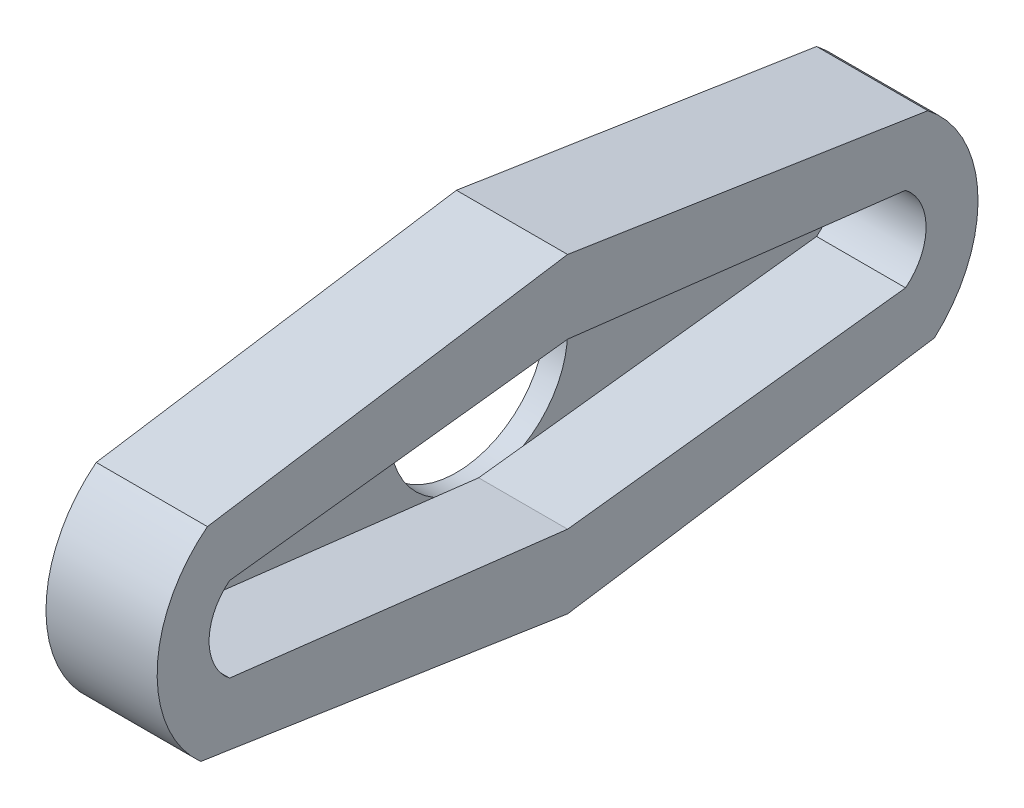
ISO-10303-21;
HEADER;
FILE_DESCRIPTION(('STEP AP214'),'2;1');
FILE_NAME('part.step','',(''),(''),'','','');
FILE_SCHEMA(('AUTOMOTIVE_DESIGN { 1 0 10303 214 1 1 1 1 }'));
ENDSEC;
DATA;
#1=APPLICATION_CONTEXT('core data for automotive mechanical design processes');
#2=APPLICATION_PROTOCOL_DEFINITION('international standard','automotive_design',2000,#1);
#3=PRODUCT_CONTEXT('',#1,'mechanical');
#4=PRODUCT('Part','Part','',(#3));
#5=PRODUCT_RELATED_PRODUCT_CATEGORY('part','',(#4));
#6=PRODUCT_DEFINITION_FORMATION('','',#4);
#7=PRODUCT_DEFINITION_CONTEXT('part definition',#1,'design');
#8=PRODUCT_DEFINITION('design','',#6,#7);
#9=PRODUCT_DEFINITION_SHAPE('','',#8);
#10=(LENGTH_UNIT() NAMED_UNIT(*) SI_UNIT(.MILLI.,.METRE.));
#11=(NAMED_UNIT(*) PLANE_ANGLE_UNIT() SI_UNIT($,.RADIAN.));
#12=(NAMED_UNIT(*) SI_UNIT($,.STERADIAN.) SOLID_ANGLE_UNIT());
#13=UNCERTAINTY_MEASURE_WITH_UNIT(LENGTH_MEASURE(1.E-05),#10,'distance_accuracy_value','');
#14=(GEOMETRIC_REPRESENTATION_CONTEXT(3) GLOBAL_UNCERTAINTY_ASSIGNED_CONTEXT((#13)) GLOBAL_UNIT_ASSIGNED_CONTEXT((#10,
#11,#12)) REPRESENTATION_CONTEXT('',''));
#15=CARTESIAN_POINT('',(0.,0.,0.));
#16=DIRECTION('',(0.,0.,1.));
#17=DIRECTION('',(1.,0.,0.));
#18=AXIS2_PLACEMENT_3D('',#15,#16,#17);
#19=CARTESIAN_POINT('',(0.,-0.125126562134235,-12.5962031359729));
#20=DIRECTION('',(-1.,0.,0.));
#21=DIRECTION('',(0.,0.,1.));
#22=AXIS2_PLACEMENT_3D('',#19,#20,#21);
#23=PLANE('',#22);
#24=CARTESIAN_POINT('',(0.,0.,0.));
#25=DIRECTION('',(1.,0.,0.));
#26=DIRECTION('',(0.,0.,-1.));
#27=AXIS2_PLACEMENT_3D('',#24,#25,#26);
#28=CIRCLE('',#27,4.);
#29=CARTESIAN_POINT('',(0.,3.46291458896751,-2.00205458205214));
#30=VERTEX_POINT('',#29);
#31=CARTESIAN_POINT('',(0.,3.46291458896751,2.00205458205214));
#32=VERTEX_POINT('',#31);
#33=EDGE_CURVE('E50',#30,#32,#28,.T.);
#34=ORIENTED_EDGE('',*,*,#33,.F.);
#35=DIRECTION('',(0.,0.117599343536163,0.993061123194269));
#36=VECTOR('',#35,1.);
#37=CARTESIAN_POINT('',(0.,3.7,0.));
#38=LINE('',#37,#36);
#39=CARTESIAN_POINT('',(0.,3.7,0.));
#40=VERTEX_POINT('',#39);
#41=EDGE_CURVE('E188',#30,#40,#38,.T.);
#42=ORIENTED_EDGE('',*,*,#41,.T.);
#43=DIRECTION('',(0.,-0.117599343536163,0.993061123194269));
#44=VECTOR('',#43,1.);
#45=CARTESIAN_POINT('',(0.,3.7,0.));
#46=LINE('',#45,#44);
#47=EDGE_CURVE('E214',#40,#32,#46,.T.);
#48=ORIENTED_EDGE('',*,*,#47,.T.);
#49=EDGE_LOOP('',(#34,#42,#48));
#50=FACE_BOUND('',#49,.T.);
#51=ADVANCED_FACE('F39',(#50),#23,.T.);
#52=CARTESIAN_POINT('',(0.,-3.46291458896751,2.00205458205214));
#53=VERTEX_POINT('',#52);
#54=CARTESIAN_POINT('',(0.,-3.46291458896751,-2.00205458205214));
#55=VERTEX_POINT('',#54);
#56=EDGE_CURVE('E11',#53,#55,#28,.T.);
#57=ORIENTED_EDGE('',*,*,#56,.F.);
#58=DIRECTION('',(0.,-0.117599343536163,-0.993061123194269));
#59=VECTOR('',#58,1.);
#60=CARTESIAN_POINT('',(0.,-1.9,15.2));
#61=LINE('',#60,#59);
#62=CARTESIAN_POINT('',(0.,-3.7,0.));
#63=VERTEX_POINT('',#62);
#64=EDGE_CURVE('E221',#53,#63,#61,.T.);
#65=ORIENTED_EDGE('',*,*,#64,.T.);
#66=DIRECTION('',(0.,0.117599343536164,-0.993061123194269));
#67=VECTOR('',#66,1.);
#68=CARTESIAN_POINT('',(0.,-1.9,-15.2));
#69=LINE('',#68,#67);
#70=EDGE_CURVE('E227',#63,#55,#69,.T.);
#71=ORIENTED_EDGE('',*,*,#70,.T.);
#72=EDGE_LOOP('',(#57,#65,#71));
#73=FACE_BOUND('',#72,.T.);
#74=ADVANCED_FACE('F310',(#73),#23,.T.);
#75=CARTESIAN_POINT('',(4.,-0.125126562134235,-12.5962031359729));
#76=DIRECTION('',(-1.,0.,0.));
#77=DIRECTION('',(0.,0.,1.));
#78=AXIS2_PLACEMENT_3D('',#75,#76,#77);
#79=PLANE('',#78);
#80=DIRECTION('',(0.,0.152515596279737,0.988301063892697));
#81=VECTOR('',#80,1.);
#82=CARTESIAN_POINT('',(4.,7.,0.));
#83=LINE('',#82,#81);
#84=CARTESIAN_POINT('',(4.,4.5,-16.2));
#85=VERTEX_POINT('',#84);
#86=CARTESIAN_POINT('',(4.,7.,0.));
#87=VERTEX_POINT('',#86);
#88=EDGE_CURVE('E253',#85,#87,#83,.T.);
#89=ORIENTED_EDGE('',*,*,#88,.T.);
#90=DIRECTION('',(0.,-0.152515596279737,0.988301063892697));
#91=VECTOR('',#90,1.);
#92=CARTESIAN_POINT('',(4.,7.,0.));
#93=LINE('',#92,#91);
#94=CARTESIAN_POINT('',(4.,4.5,16.2));
#95=VERTEX_POINT('',#94);
#96=EDGE_CURVE('E147',#87,#95,#93,.T.);
#97=ORIENTED_EDGE('',*,*,#96,.T.);
#98=CARTESIAN_POINT('',(4.,-0.125126562134238,12.5962031359729));
#99=DIRECTION('',(1.,0.,0.));
#100=DIRECTION('',(0.,0.,-1.));
#101=AXIS2_PLACEMENT_3D('',#98,#99,#100);
#102=CIRCLE('',#101,5.8633733936132);
#103=CARTESIAN_POINT('',(4.,-4.5,16.5));
#104=VERTEX_POINT('',#103);
#105=EDGE_CURVE('E258',#95,#104,#102,.T.);
#106=ORIENTED_EDGE('',*,*,#105,.T.);
#107=DIRECTION('',(0.,-0.149805379427995,-0.988715504224767));
#108=VECTOR('',#107,1.);
#109=CARTESIAN_POINT('',(4.,-4.5,16.5));
#110=LINE('',#109,#108);
#111=CARTESIAN_POINT('',(4.,-7.,0.));
#112=VERTEX_POINT('',#111);
#113=EDGE_CURVE('E261',#104,#112,#110,.T.);
#114=ORIENTED_EDGE('',*,*,#113,.T.);
#115=DIRECTION('',(0.,0.149805379427995,-0.988715504224767));
#116=VECTOR('',#115,1.);
#117=CARTESIAN_POINT('',(4.,-4.5,-16.5));
#118=LINE('',#117,#116);
#119=CARTESIAN_POINT('',(4.,-4.5,-16.5));
#120=VERTEX_POINT('',#119);
#121=EDGE_CURVE('E264',#112,#120,#118,.T.);
#122=ORIENTED_EDGE('',*,*,#121,.T.);
#123=CARTESIAN_POINT('',(4.,-0.125126562134235,-12.5962031359729));
#124=DIRECTION('',(1.,0.,0.));
#125=DIRECTION('',(0.,0.,1.));
#126=AXIS2_PLACEMENT_3D('',#123,#124,#125);
#127=CIRCLE('',#126,5.8633733936132);
#128=EDGE_CURVE('E267',#120,#85,#127,.T.);
#129=ORIENTED_EDGE('',*,*,#128,.T.);
#130=EDGE_LOOP('',(#89,#97,#106,#114,#122,#129));
#131=FACE_BOUND('',#130,.T.);
#132=DIRECTION('',(0.,0.117599343536163,0.993061123194269));
#133=VECTOR('',#132,1.);
#134=CARTESIAN_POINT('',(4.,3.7,0.));
#135=LINE('',#134,#133);
#136=CARTESIAN_POINT('',(4.,1.9,-15.2));
#137=VERTEX_POINT('',#136);
#138=CARTESIAN_POINT('',(4.,3.7,0.));
#139=VERTEX_POINT('',#138);
#140=EDGE_CURVE('E189',#137,#139,#135,.T.);
#141=ORIENTED_EDGE('',*,*,#140,.F.);
#142=CARTESIAN_POINT('',(4.,0.,-13.7066815476932));
#143=DIRECTION('',(1.,0.,0.));
#144=DIRECTION('',(0.,0.,1.));
#145=AXIS2_PLACEMENT_3D('',#142,#143,#144);
#146=CIRCLE('',#145,2.41660919471891);
#147=CARTESIAN_POINT('',(4.,-1.9,-15.2));
#148=VERTEX_POINT('',#147);
#149=EDGE_CURVE('E206',#148,#137,#146,.T.);
#150=ORIENTED_EDGE('',*,*,#149,.F.);
#151=DIRECTION('',(0.,0.117599343536164,-0.993061123194269));
#152=VECTOR('',#151,1.);
#153=CARTESIAN_POINT('',(4.,-1.9,-15.2));
#154=LINE('',#153,#152);
#155=CARTESIAN_POINT('',(4.,-3.7,0.));
#156=VERTEX_POINT('',#155);
#157=EDGE_CURVE('E202',#156,#148,#154,.T.);
#158=ORIENTED_EDGE('',*,*,#157,.F.);
#159=DIRECTION('',(0.,-0.117599343536163,-0.993061123194269));
#160=VECTOR('',#159,1.);
#161=CARTESIAN_POINT('',(4.,-1.9,15.2));
#162=LINE('',#161,#160);
#163=CARTESIAN_POINT('',(4.,-1.9,15.2));
#164=VERTEX_POINT('',#163);
#165=EDGE_CURVE('E199',#164,#156,#162,.T.);
#166=ORIENTED_EDGE('',*,*,#165,.F.);
#167=CARTESIAN_POINT('',(4.,0.,13.7066815476932));
#168=DIRECTION('',(1.,0.,0.));
#169=DIRECTION('',(0.,0.,-1.));
#170=AXIS2_PLACEMENT_3D('',#167,#168,#169);
#171=CIRCLE('',#170,2.41660919471891);
#172=CARTESIAN_POINT('',(4.,1.9,15.2));
#173=VERTEX_POINT('',#172);
#174=EDGE_CURVE('E196',#173,#164,#171,.T.);
#175=ORIENTED_EDGE('',*,*,#174,.F.);
#176=DIRECTION('',(0.,-0.117599343536163,0.993061123194269));
#177=VECTOR('',#176,1.);
#178=CARTESIAN_POINT('',(4.,3.7,0.));
#179=LINE('',#178,#177);
#180=EDGE_CURVE('E192',#139,#173,#179,.T.);
#181=ORIENTED_EDGE('',*,*,#180,.F.);
#182=EDGE_LOOP('',(#141,#150,#158,#166,#175,#181));
#183=FACE_BOUND('',#182,.T.);
#184=ADVANCED_FACE('F287',(#131,#183),#79,.F.);
#185=CARTESIAN_POINT('',(4.,7.,0.));
#186=DIRECTION('',(0.,-0.988301063892697,0.152515596279737));
#187=DIRECTION('',(0.,-0.152515596279737,-0.988301063892697));
#188=AXIS2_PLACEMENT_3D('',#185,#186,#187);
#189=PLANE('',#188);
#190=DIRECTION('',(-1.,0.,0.));
#191=VECTOR('',#190,1.);
#192=CARTESIAN_POINT('',(4.,4.5,-16.2));
#193=LINE('',#192,#191);
#194=CARTESIAN_POINT('',(-1.,4.5,-16.2));
#195=VERTEX_POINT('',#194);
#196=EDGE_CURVE('E167',#85,#195,#193,.T.);
#197=ORIENTED_EDGE('',*,*,#196,.T.);
#198=DIRECTION('',(0.,0.152515596279737,0.988301063892697));
#199=VECTOR('',#198,1.);
#200=CARTESIAN_POINT('',(-1.,7.,0.));
#201=LINE('',#200,#199);
#202=CARTESIAN_POINT('',(-1.,7.,0.));
#203=VERTEX_POINT('',#202);
#204=EDGE_CURVE('E159',#195,#203,#201,.T.);
#205=ORIENTED_EDGE('',*,*,#204,.T.);
#206=DIRECTION('',(-1.,0.,0.));
#207=VECTOR('',#206,1.);
#208=CARTESIAN_POINT('',(4.,7.,0.));
#209=LINE('',#208,#207);
#210=EDGE_CURVE('E43',#87,#203,#209,.T.);
#211=ORIENTED_EDGE('',*,*,#210,.F.);
#212=ORIENTED_EDGE('',*,*,#88,.F.);
#213=EDGE_LOOP('',(#197,#205,#211,#212));
#214=FACE_BOUND('',#213,.T.);
#215=ADVANCED_FACE('F41',(#214),#189,.F.);
#216=CARTESIAN_POINT('',(4.,7.,0.));
#217=DIRECTION('',(0.,-0.988301063892697,-0.152515596279737));
#218=DIRECTION('',(0.,0.152515596279737,-0.988301063892697));
#219=AXIS2_PLACEMENT_3D('',#216,#217,#218);
#220=PLANE('',#219);
#221=ORIENTED_EDGE('',*,*,#210,.T.);
#222=DIRECTION('',(0.,-0.152515596279737,0.988301063892697));
#223=VECTOR('',#222,1.);
#224=CARTESIAN_POINT('',(-1.,7.,0.));
#225=LINE('',#224,#223);
#226=CARTESIAN_POINT('',(-1.,4.5,16.2));
#227=VERTEX_POINT('',#226);
#228=EDGE_CURVE('E146',#203,#227,#225,.T.);
#229=ORIENTED_EDGE('',*,*,#228,.T.);
#230=DIRECTION('',(-1.,0.,0.));
#231=VECTOR('',#230,1.);
#232=CARTESIAN_POINT('',(4.,4.5,16.2));
#233=LINE('',#232,#231);
#234=EDGE_CURVE('E153',#95,#227,#233,.T.);
#235=ORIENTED_EDGE('',*,*,#234,.F.);
#236=ORIENTED_EDGE('',*,*,#96,.F.);
#237=EDGE_LOOP('',(#221,#229,#235,#236));
#238=FACE_BOUND('',#237,.T.);
#239=ADVANCED_FACE('F144',(#238),#220,.F.);
#240=CARTESIAN_POINT('',(4.,-0.125126562134238,12.5962031359729));
#241=DIRECTION('',(-1.,0.,0.));
#242=DIRECTION('',(0.,0.,1.));
#243=AXIS2_PLACEMENT_3D('',#240,#241,#242);
#244=CYLINDRICAL_SURFACE('',#243,5.8633733936132);
#245=ORIENTED_EDGE('',*,*,#234,.T.);
#246=CARTESIAN_POINT('',(-1.,-0.125126562134238,12.5962031359729));
#247=DIRECTION('',(1.,0.,0.));
#248=DIRECTION('',(0.,0.,-1.));
#249=AXIS2_PLACEMENT_3D('',#246,#247,#248);
#250=CIRCLE('',#249,5.8633733936132);
#251=CARTESIAN_POINT('',(-1.,-4.5,16.5));
#252=VERTEX_POINT('',#251);
#253=EDGE_CURVE('E163',#227,#252,#250,.T.);
#254=ORIENTED_EDGE('',*,*,#253,.T.);
#255=DIRECTION('',(-1.,0.,0.));
#256=VECTOR('',#255,1.);
#257=CARTESIAN_POINT('',(4.,-4.5,16.5));
#258=LINE('',#257,#256);
#259=EDGE_CURVE('E278',#104,#252,#258,.T.);
#260=ORIENTED_EDGE('',*,*,#259,.F.);
#261=ORIENTED_EDGE('',*,*,#105,.F.);
#262=EDGE_LOOP('',(#245,#254,#260,#261));
#263=FACE_BOUND('',#262,.T.);
#264=ADVANCED_FACE('F283',(#263),#244,.T.);
#265=CARTESIAN_POINT('',(4.,-4.5,16.5));
#266=DIRECTION('',(0.,0.988715504224767,-0.149805379427995));
#267=DIRECTION('',(0.,0.149805379427995,0.988715504224767));
#268=AXIS2_PLACEMENT_3D('',#265,#266,#267);
#269=PLANE('',#268);
#270=ORIENTED_EDGE('',*,*,#259,.T.);
#271=DIRECTION('',(0.,-0.149805379427995,-0.988715504224767));
#272=VECTOR('',#271,1.);
#273=CARTESIAN_POINT('',(-1.,-4.5,16.5));
#274=LINE('',#273,#272);
#275=CARTESIAN_POINT('',(-1.,-7.,0.));
#276=VERTEX_POINT('',#275);
#277=EDGE_CURVE('E177',#252,#276,#274,.T.);
#278=ORIENTED_EDGE('',*,*,#277,.T.);
#279=DIRECTION('',(-1.,0.,0.));
#280=VECTOR('',#279,1.);
#281=CARTESIAN_POINT('',(4.,-7.,0.));
#282=LINE('',#281,#280);
#283=EDGE_CURVE('E275',#112,#276,#282,.T.);
#284=ORIENTED_EDGE('',*,*,#283,.F.);
#285=ORIENTED_EDGE('',*,*,#113,.F.);
#286=EDGE_LOOP('',(#270,#278,#284,#285));
#287=FACE_BOUND('',#286,.T.);
#288=ADVANCED_FACE('F298',(#287),#269,.F.);
#289=CARTESIAN_POINT('',(4.,-4.5,-16.5));
#290=DIRECTION('',(0.,0.988715504224767,0.149805379427995));
#291=DIRECTION('',(0.,-0.149805379427995,0.988715504224767));
#292=AXIS2_PLACEMENT_3D('',#289,#290,#291);
#293=PLANE('',#292);
#294=ORIENTED_EDGE('',*,*,#283,.T.);
#295=DIRECTION('',(0.,0.149805379427995,-0.988715504224767));
#296=VECTOR('',#295,1.);
#297=CARTESIAN_POINT('',(-1.,-4.5,-16.5));
#298=LINE('',#297,#296);
#299=CARTESIAN_POINT('',(-1.,-4.5,-16.5));
#300=VERTEX_POINT('',#299);
#301=EDGE_CURVE('E181',#276,#300,#298,.T.);
#302=ORIENTED_EDGE('',*,*,#301,.T.);
#303=DIRECTION('',(-1.,0.,0.));
#304=VECTOR('',#303,1.);
#305=CARTESIAN_POINT('',(4.,-4.5,-16.5));
#306=LINE('',#305,#304);
#307=EDGE_CURVE('E272',#120,#300,#306,.T.);
#308=ORIENTED_EDGE('',*,*,#307,.F.);
#309=ORIENTED_EDGE('',*,*,#121,.F.);
#310=EDGE_LOOP('',(#294,#302,#308,#309));
#311=FACE_BOUND('',#310,.T.);
#312=ADVANCED_FACE('F299',(#311),#293,.F.);
#313=CARTESIAN_POINT('',(4.,-0.125126562134235,-12.5962031359729));
#314=DIRECTION('',(-1.,0.,0.));
#315=DIRECTION('',(0.,0.,1.));
#316=AXIS2_PLACEMENT_3D('',#313,#314,#315);
#317=CYLINDRICAL_SURFACE('',#316,5.8633733936132);
#318=ORIENTED_EDGE('',*,*,#307,.T.);
#319=CARTESIAN_POINT('',(-1.,-0.125126562134238,-12.5962031359729));
#320=DIRECTION('',(1.,0.,0.));
#321=DIRECTION('',(0.,0.,1.));
#322=AXIS2_PLACEMENT_3D('',#319,#320,#321);
#323=CIRCLE('',#322,5.8633733936132);
#324=EDGE_CURVE('E185',#300,#195,#323,.T.);
#325=ORIENTED_EDGE('',*,*,#324,.T.);
#326=ORIENTED_EDGE('',*,*,#196,.F.);
#327=ORIENTED_EDGE('',*,*,#128,.F.);
#328=EDGE_LOOP('',(#318,#325,#326,#327));
#329=FACE_BOUND('',#328,.T.);
#330=ADVANCED_FACE('F294',(#329),#317,.T.);
#331=CARTESIAN_POINT('',(4.,3.7,0.));
#332=DIRECTION('',(0.,-0.993061123194269,0.117599343536163));
#333=DIRECTION('',(0.,-0.117599343536163,-0.993061123194269));
#334=AXIS2_PLACEMENT_3D('',#331,#332,#333);
#335=PLANE('',#334);
#336=CARTESIAN_POINT('',(0.,1.9,-15.2));
#337=VERTEX_POINT('',#336);
#338=EDGE_CURVE('E210',#337,#30,#38,.T.);
#339=ORIENTED_EDGE('',*,*,#338,.F.);
#340=DIRECTION('',(-1.,0.,0.));
#341=VECTOR('',#340,1.);
#342=CARTESIAN_POINT('',(4.,1.9,-15.2));
#343=LINE('',#342,#341);
#344=EDGE_CURVE('E209',#137,#337,#343,.T.);
#345=ORIENTED_EDGE('',*,*,#344,.F.);
#346=ORIENTED_EDGE('',*,*,#140,.T.);
#347=DIRECTION('',(-1.,0.,0.));
#348=VECTOR('',#347,1.);
#349=CARTESIAN_POINT('',(4.,3.7,0.));
#350=LINE('',#349,#348);
#351=EDGE_CURVE('E249',#139,#40,#350,.T.);
#352=ORIENTED_EDGE('',*,*,#351,.T.);
#353=ORIENTED_EDGE('',*,*,#41,.F.);
#354=EDGE_LOOP('',(#339,#345,#346,#352,#353));
#355=FACE_BOUND('',#354,.T.);
#356=ADVANCED_FACE('F306',(#355),#335,.T.);
#357=CARTESIAN_POINT('',(4.,3.7,0.));
#358=DIRECTION('',(0.,-0.993061123194269,-0.117599343536163));
#359=DIRECTION('',(0.,0.117599343536163,-0.993061123194269));
#360=AXIS2_PLACEMENT_3D('',#357,#358,#359);
#361=PLANE('',#360);
#362=ORIENTED_EDGE('',*,*,#47,.F.);
#363=ORIENTED_EDGE('',*,*,#351,.F.);
#364=ORIENTED_EDGE('',*,*,#180,.T.);
#365=DIRECTION('',(-1.,0.,0.));
#366=VECTOR('',#365,1.);
#367=CARTESIAN_POINT('',(4.,1.9,15.2));
#368=LINE('',#367,#366);
#369=CARTESIAN_POINT('',(0.,1.9,15.2));
#370=VERTEX_POINT('',#369);
#371=EDGE_CURVE('E246',#173,#370,#368,.T.);
#372=ORIENTED_EDGE('',*,*,#371,.T.);
#373=EDGE_CURVE('E64',#32,#370,#46,.T.);
#374=ORIENTED_EDGE('',*,*,#373,.F.);
#375=EDGE_LOOP('',(#362,#363,#364,#372,#374));
#376=FACE_BOUND('',#375,.T.);
#377=ADVANCED_FACE('F321',(#376),#361,.T.);
#378=CARTESIAN_POINT('',(4.,0.,13.7066815476932));
#379=DIRECTION('',(-1.,0.,0.));
#380=DIRECTION('',(0.,0.,1.));
#381=AXIS2_PLACEMENT_3D('',#378,#379,#380);
#382=CYLINDRICAL_SURFACE('',#381,2.41660919471891);
#383=CARTESIAN_POINT('',(0.,0.,13.7066815476932));
#384=DIRECTION('',(1.,0.,0.));
#385=DIRECTION('',(0.,0.,-1.));
#386=AXIS2_PLACEMENT_3D('',#383,#384,#385);
#387=CIRCLE('',#386,2.41660919471891);
#388=CARTESIAN_POINT('',(0.,-1.9,15.2));
#389=VERTEX_POINT('',#388);
#390=EDGE_CURVE('E217',#370,#389,#387,.T.);
#391=ORIENTED_EDGE('',*,*,#390,.F.);
#392=ORIENTED_EDGE('',*,*,#371,.F.);
#393=ORIENTED_EDGE('',*,*,#174,.T.);
#394=DIRECTION('',(-1.,0.,0.));
#395=VECTOR('',#394,1.);
#396=CARTESIAN_POINT('',(4.,-1.9,15.2));
#397=LINE('',#396,#395);
#398=EDGE_CURVE('E243',#164,#389,#397,.T.);
#399=ORIENTED_EDGE('',*,*,#398,.T.);
#400=EDGE_LOOP('',(#391,#392,#393,#399));
#401=FACE_BOUND('',#400,.T.);
#402=ADVANCED_FACE('F325',(#401),#382,.F.);
#403=CARTESIAN_POINT('',(4.,-1.9,15.2));
#404=DIRECTION('',(0.,0.993061123194269,-0.117599343536163));
#405=DIRECTION('',(0.,0.117599343536163,0.993061123194269));
#406=AXIS2_PLACEMENT_3D('',#403,#404,#405);
#407=PLANE('',#406);
#408=EDGE_CURVE('E222',#389,#53,#61,.T.);
#409=ORIENTED_EDGE('',*,*,#408,.F.);
#410=ORIENTED_EDGE('',*,*,#398,.F.);
#411=ORIENTED_EDGE('',*,*,#165,.T.);
#412=DIRECTION('',(-1.,0.,0.));
#413=VECTOR('',#412,1.);
#414=CARTESIAN_POINT('',(4.,-3.7,0.));
#415=LINE('',#414,#413);
#416=EDGE_CURVE('E239',#156,#63,#415,.T.);
#417=ORIENTED_EDGE('',*,*,#416,.T.);
#418=ORIENTED_EDGE('',*,*,#64,.F.);
#419=EDGE_LOOP('',(#409,#410,#411,#417,#418));
#420=FACE_BOUND('',#419,.T.);
#421=ADVANCED_FACE('F328',(#420),#407,.T.);
#422=CARTESIAN_POINT('',(4.,-1.9,-15.2));
#423=DIRECTION('',(0.,0.993061123194269,0.117599343536164));
#424=DIRECTION('',(0.,-0.117599343536164,0.993061123194269));
#425=AXIS2_PLACEMENT_3D('',#422,#423,#424);
#426=PLANE('',#425);
#427=ORIENTED_EDGE('',*,*,#70,.F.);
#428=ORIENTED_EDGE('',*,*,#416,.F.);
#429=ORIENTED_EDGE('',*,*,#157,.T.);
#430=DIRECTION('',(-1.,0.,0.));
#431=VECTOR('',#430,1.);
#432=CARTESIAN_POINT('',(4.,-1.9,-15.2));
#433=LINE('',#432,#431);
#434=CARTESIAN_POINT('',(0.,-1.9,-15.2));
#435=VERTEX_POINT('',#434);
#436=EDGE_CURVE('E236',#148,#435,#433,.T.);
#437=ORIENTED_EDGE('',*,*,#436,.T.);
#438=EDGE_CURVE('E226',#55,#435,#69,.T.);
#439=ORIENTED_EDGE('',*,*,#438,.F.);
#440=EDGE_LOOP('',(#427,#428,#429,#437,#439));
#441=FACE_BOUND('',#440,.T.);
#442=ADVANCED_FACE('F332',(#441),#426,.T.);
#443=CARTESIAN_POINT('',(4.,0.,-13.7066815476932));
#444=DIRECTION('',(-1.,0.,0.));
#445=DIRECTION('',(0.,0.,1.));
#446=AXIS2_PLACEMENT_3D('',#443,#444,#445);
#447=CYLINDRICAL_SURFACE('',#446,2.41660919471891);
#448=CARTESIAN_POINT('',(0.,0.,-13.7066815476932));
#449=DIRECTION('',(1.,0.,0.));
#450=DIRECTION('',(0.,0.,1.));
#451=AXIS2_PLACEMENT_3D('',#448,#449,#450);
#452=CIRCLE('',#451,2.41660919471891);
#453=EDGE_CURVE('E193',#435,#337,#452,.T.);
#454=ORIENTED_EDGE('',*,*,#453,.F.);
#455=ORIENTED_EDGE('',*,*,#436,.F.);
#456=ORIENTED_EDGE('',*,*,#149,.T.);
#457=ORIENTED_EDGE('',*,*,#344,.T.);
#458=EDGE_LOOP('',(#454,#455,#456,#457));
#459=FACE_BOUND('',#458,.T.);
#460=ADVANCED_FACE('F336',(#459),#447,.F.);
#461=CARTESIAN_POINT('',(0.,-0.125126562134238,-12.5962031359729));
#462=DIRECTION('',(-1.,0.,0.));
#463=DIRECTION('',(0.,0.,1.));
#464=AXIS2_PLACEMENT_3D('',#461,#462,#463);
#465=PLANE('',#464);
#466=EDGE_CURVE('E51',#32,#53,#28,.T.);
#467=ORIENTED_EDGE('',*,*,#466,.F.);
#468=ORIENTED_EDGE('',*,*,#373,.T.);
#469=ORIENTED_EDGE('',*,*,#390,.T.);
#470=ORIENTED_EDGE('',*,*,#408,.T.);
#471=EDGE_LOOP('',(#467,#468,#469,#470));
#472=FACE_BOUND('',#471,.T.);
#473=ADVANCED_FACE('F340',(#472),#465,.F.);
#474=ORIENTED_EDGE('',*,*,#453,.T.);
#475=ORIENTED_EDGE('',*,*,#338,.T.);
#476=EDGE_CURVE('E361',#55,#30,#28,.T.);
#477=ORIENTED_EDGE('',*,*,#476,.F.);
#478=ORIENTED_EDGE('',*,*,#438,.T.);
#479=EDGE_LOOP('',(#474,#475,#477,#478));
#480=FACE_BOUND('',#479,.T.);
#481=ADVANCED_FACE('F344',(#480),#465,.F.);
#482=CARTESIAN_POINT('',(-1.,-0.125126562134238,-12.5962031359729));
#483=DIRECTION('',(-1.,0.,0.));
#484=DIRECTION('',(0.,0.,1.));
#485=AXIS2_PLACEMENT_3D('',#482,#483,#484);
#486=PLANE('',#485);
#487=CARTESIAN_POINT('',(-1.,0.,0.));
#488=DIRECTION('',(1.,0.,0.));
#489=DIRECTION('',(0.,0.,-1.));
#490=AXIS2_PLACEMENT_3D('',#487,#488,#489);
#491=CIRCLE('',#490,4.);
#492=CARTESIAN_POINT('',(-1.,0.,-4.));
#493=VERTEX_POINT('',#492);
#494=EDGE_CURVE('E169',#493,#493,#491,.T.);
#495=ORIENTED_EDGE('',*,*,#494,.T.);
#496=EDGE_LOOP('',(#495));
#497=FACE_BOUND('',#496,.T.);
#498=ORIENTED_EDGE('',*,*,#204,.F.);
#499=ORIENTED_EDGE('',*,*,#324,.F.);
#500=ORIENTED_EDGE('',*,*,#301,.F.);
#501=ORIENTED_EDGE('',*,*,#277,.F.);
#502=ORIENTED_EDGE('',*,*,#253,.F.);
#503=ORIENTED_EDGE('',*,*,#228,.F.);
#504=EDGE_LOOP('',(#498,#499,#500,#501,#502,#503));
#505=FACE_BOUND('',#504,.T.);
#506=ADVANCED_FACE('F157',(#497,#505),#486,.T.);
#507=CARTESIAN_POINT('',(-1.,0.,0.));
#508=DIRECTION('',(1.,0.,0.));
#509=DIRECTION('',(0.,0.,-1.));
#510=AXIS2_PLACEMENT_3D('',#507,#508,#509);
#511=CYLINDRICAL_SURFACE('',#510,4.);
#512=ORIENTED_EDGE('',*,*,#494,.F.);
#513=EDGE_LOOP('',(#512));
#514=FACE_BOUND('',#513,.T.);
#515=ORIENTED_EDGE('',*,*,#33,.T.);
#516=ORIENTED_EDGE('',*,*,#466,.T.);
#517=ORIENTED_EDGE('',*,*,#56,.T.);
#518=ORIENTED_EDGE('',*,*,#476,.T.);
#519=EDGE_LOOP('',(#515,#516,#517,#518));
#520=FACE_BOUND('',#519,.T.);
#521=ADVANCED_FACE('F348',(#514,#520),#511,.F.);
#522=CLOSED_SHELL('',(#51,#74,#184,#215,#239,#264,#288,#312,#330,#356,#377,#402,#421,#442,#460,
#473,#481,#506,#521));
#523=MANIFOLD_SOLID_BREP('B2',#522);
#524=ADVANCED_BREP_SHAPE_REPRESENTATION('',(#18,#523),#14);
#525=SHAPE_DEFINITION_REPRESENTATION(#9,#524);
ENDSEC;
END-ISO-10303-21;
